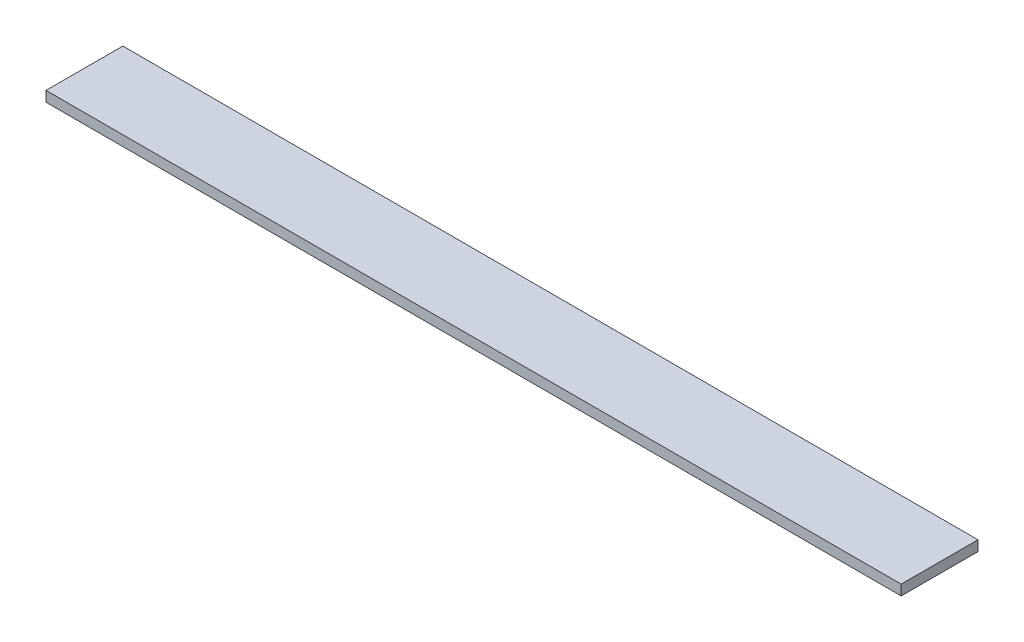
ISO-10303-21;
HEADER;
FILE_DESCRIPTION(('STEP AP214'),'2;1');
FILE_NAME('part.step','',(''),(''),'','','');
FILE_SCHEMA(('AUTOMOTIVE_DESIGN { 1 0 10303 214 1 1 1 1 }'));
ENDSEC;
DATA;
#1=APPLICATION_CONTEXT('core data for automotive mechanical design processes');
#2=APPLICATION_PROTOCOL_DEFINITION('international standard','automotive_design',2000,#1);
#3=PRODUCT_CONTEXT('',#1,'mechanical');
#4=PRODUCT('Part','Part','',(#3));
#5=PRODUCT_RELATED_PRODUCT_CATEGORY('part','',(#4));
#6=PRODUCT_DEFINITION_FORMATION('','',#4);
#7=PRODUCT_DEFINITION_CONTEXT('part definition',#1,'design');
#8=PRODUCT_DEFINITION('design','',#6,#7);
#9=PRODUCT_DEFINITION_SHAPE('','',#8);
#10=(LENGTH_UNIT() NAMED_UNIT(*) SI_UNIT(.MILLI.,.METRE.));
#11=(NAMED_UNIT(*) PLANE_ANGLE_UNIT() SI_UNIT($,.RADIAN.));
#12=(NAMED_UNIT(*) SI_UNIT($,.STERADIAN.) SOLID_ANGLE_UNIT());
#13=UNCERTAINTY_MEASURE_WITH_UNIT(LENGTH_MEASURE(1.E-05),#10,'distance_accuracy_value','');
#14=(GEOMETRIC_REPRESENTATION_CONTEXT(3) GLOBAL_UNCERTAINTY_ASSIGNED_CONTEXT((#13)) GLOBAL_UNIT_ASSIGNED_CONTEXT((#10,
#11,#12)) REPRESENTATION_CONTEXT('',''));
#15=CARTESIAN_POINT('',(0.,0.,0.));
#16=DIRECTION('',(0.,0.,1.));
#17=DIRECTION('',(1.,0.,0.));
#18=AXIS2_PLACEMENT_3D('',#15,#16,#17);
#19=CARTESIAN_POINT('',(334.,-2.,-15.));
#20=DIRECTION('',(0.,0.,1.));
#21=DIRECTION('',(1.,0.,0.));
#22=AXIS2_PLACEMENT_3D('',#19,#20,#21);
#23=PLANE('',#22);
#24=DIRECTION('',(0.,1.,0.));
#25=VECTOR('',#24,1.);
#26=CARTESIAN_POINT('',(0.,-2.,-15.));
#27=LINE('',#26,#25);
#28=CARTESIAN_POINT('',(0.,-2.,-15.));
#29=VERTEX_POINT('',#28);
#30=CARTESIAN_POINT('',(0.,2.,-15.));
#31=VERTEX_POINT('',#30);
#32=EDGE_CURVE('E97',#29,#31,#27,.T.);
#33=ORIENTED_EDGE('',*,*,#32,.T.);
#34=DIRECTION('',(-1.,0.,0.));
#35=VECTOR('',#34,1.);
#36=CARTESIAN_POINT('',(334.,2.,-15.));
#37=LINE('',#36,#35);
#38=CARTESIAN_POINT('',(334.,2.,-15.));
#39=VERTEX_POINT('',#38);
#40=EDGE_CURVE('E11',#39,#31,#37,.T.);
#41=ORIENTED_EDGE('',*,*,#40,.F.);
#42=DIRECTION('',(0.,1.,0.));
#43=VECTOR('',#42,1.);
#44=CARTESIAN_POINT('',(334.,-2.,-15.));
#45=LINE('',#44,#43);
#46=CARTESIAN_POINT('',(334.,-2.,-15.));
#47=VERTEX_POINT('',#46);
#48=EDGE_CURVE('E85',#47,#39,#45,.T.);
#49=ORIENTED_EDGE('',*,*,#48,.F.);
#50=DIRECTION('',(-1.,0.,0.));
#51=VECTOR('',#50,1.);
#52=CARTESIAN_POINT('',(334.,-2.,-15.));
#53=LINE('',#52,#51);
#54=EDGE_CURVE('E93',#47,#29,#53,.T.);
#55=ORIENTED_EDGE('',*,*,#54,.T.);
#56=EDGE_LOOP('',(#33,#41,#49,#55));
#57=FACE_BOUND('',#56,.T.);
#58=ADVANCED_FACE('F34',(#57),#23,.F.);
#59=CARTESIAN_POINT('',(334.,2.,15.));
#60=DIRECTION('',(0.,-1.,0.));
#61=DIRECTION('',(0.,0.,-1.));
#62=AXIS2_PLACEMENT_3D('',#59,#60,#61);
#63=PLANE('',#62);
#64=DIRECTION('',(0.,0.,1.));
#65=VECTOR('',#64,1.);
#66=CARTESIAN_POINT('',(0.,2.,15.));
#67=LINE('',#66,#65);
#68=CARTESIAN_POINT('',(0.,2.,15.));
#69=VERTEX_POINT('',#68);
#70=EDGE_CURVE('E89',#31,#69,#67,.T.);
#71=ORIENTED_EDGE('',*,*,#70,.T.);
#72=DIRECTION('',(-1.,0.,0.));
#73=VECTOR('',#72,1.);
#74=CARTESIAN_POINT('',(334.,2.,15.));
#75=LINE('',#74,#73);
#76=CARTESIAN_POINT('',(334.,2.,15.));
#77=VERTEX_POINT('',#76);
#78=EDGE_CURVE('E42',#77,#69,#75,.T.);
#79=ORIENTED_EDGE('',*,*,#78,.F.);
#80=DIRECTION('',(0.,0.,1.));
#81=VECTOR('',#80,1.);
#82=CARTESIAN_POINT('',(334.,2.,15.));
#83=LINE('',#82,#81);
#84=EDGE_CURVE('E80',#39,#77,#83,.T.);
#85=ORIENTED_EDGE('',*,*,#84,.F.);
#86=ORIENTED_EDGE('',*,*,#40,.T.);
#87=EDGE_LOOP('',(#71,#79,#85,#86));
#88=FACE_BOUND('',#87,.T.);
#89=ADVANCED_FACE('F88',(#88),#63,.F.);
#90=CARTESIAN_POINT('',(334.,-2.,15.));
#91=DIRECTION('',(0.,0.,-1.));
#92=DIRECTION('',(-1.,0.,0.));
#93=AXIS2_PLACEMENT_3D('',#90,#91,#92);
#94=PLANE('',#93);
#95=DIRECTION('',(0.,-1.,0.));
#96=VECTOR('',#95,1.);
#97=CARTESIAN_POINT('',(0.,-2.,15.));
#98=LINE('',#97,#96);
#99=CARTESIAN_POINT('',(0.,-2.,15.));
#100=VERTEX_POINT('',#99);
#101=EDGE_CURVE('E67',#69,#100,#98,.T.);
#102=ORIENTED_EDGE('',*,*,#101,.T.);
#103=DIRECTION('',(-1.,0.,0.));
#104=VECTOR('',#103,1.);
#105=CARTESIAN_POINT('',(334.,-2.,15.));
#106=LINE('',#105,#104);
#107=CARTESIAN_POINT('',(334.,-2.,15.));
#108=VERTEX_POINT('',#107);
#109=EDGE_CURVE('E90',#108,#100,#106,.T.);
#110=ORIENTED_EDGE('',*,*,#109,.F.);
#111=DIRECTION('',(0.,-1.,0.));
#112=VECTOR('',#111,1.);
#113=CARTESIAN_POINT('',(334.,-2.,15.));
#114=LINE('',#113,#112);
#115=EDGE_CURVE('E83',#77,#108,#114,.T.);
#116=ORIENTED_EDGE('',*,*,#115,.F.);
#117=ORIENTED_EDGE('',*,*,#78,.T.);
#118=EDGE_LOOP('',(#102,#110,#116,#117));
#119=FACE_BOUND('',#118,.T.);
#120=ADVANCED_FACE('F91',(#119),#94,.F.);
#121=CARTESIAN_POINT('',(334.,-2.,15.));
#122=DIRECTION('',(0.,1.,0.));
#123=DIRECTION('',(0.,0.,1.));
#124=AXIS2_PLACEMENT_3D('',#121,#122,#123);
#125=PLANE('',#124);
#126=DIRECTION('',(0.,0.,-1.));
#127=VECTOR('',#126,1.);
#128=CARTESIAN_POINT('',(0.,-2.,15.));
#129=LINE('',#128,#127);
#130=EDGE_CURVE('E73',#100,#29,#129,.T.);
#131=ORIENTED_EDGE('',*,*,#130,.T.);
#132=ORIENTED_EDGE('',*,*,#54,.F.);
#133=DIRECTION('',(0.,0.,-1.));
#134=VECTOR('',#133,1.);
#135=CARTESIAN_POINT('',(334.,-2.,15.));
#136=LINE('',#135,#134);
#137=EDGE_CURVE('E50',#108,#47,#136,.T.);
#138=ORIENTED_EDGE('',*,*,#137,.F.);
#139=ORIENTED_EDGE('',*,*,#109,.T.);
#140=EDGE_LOOP('',(#131,#132,#138,#139));
#141=FACE_BOUND('',#140,.T.);
#142=ADVANCED_FACE('F104',(#141),#125,.F.);
#143=CARTESIAN_POINT('',(334.,0.,0.));
#144=DIRECTION('',(-1.,0.,0.));
#145=DIRECTION('',(0.,0.,1.));
#146=AXIS2_PLACEMENT_3D('',#143,#144,#145);
#147=PLANE('',#146);
#148=ORIENTED_EDGE('',*,*,#48,.T.);
#149=ORIENTED_EDGE('',*,*,#84,.T.);
#150=ORIENTED_EDGE('',*,*,#115,.T.);
#151=ORIENTED_EDGE('',*,*,#137,.T.);
#152=EDGE_LOOP('',(#148,#149,#150,#151));
#153=FACE_BOUND('',#152,.T.);
#154=ADVANCED_FACE('F81',(#153),#147,.F.);
#155=CARTESIAN_POINT('',(0.,0.,0.));
#156=DIRECTION('',(-1.,0.,0.));
#157=DIRECTION('',(0.,0.,1.));
#158=AXIS2_PLACEMENT_3D('',#155,#156,#157);
#159=PLANE('',#158);
#160=ORIENTED_EDGE('',*,*,#32,.F.);
#161=ORIENTED_EDGE('',*,*,#130,.F.);
#162=ORIENTED_EDGE('',*,*,#101,.F.);
#163=ORIENTED_EDGE('',*,*,#70,.F.);
#164=EDGE_LOOP('',(#160,#161,#162,#163));
#165=FACE_BOUND('',#164,.T.);
#166=ADVANCED_FACE('F107',(#165),#159,.T.);
#167=CLOSED_SHELL('',(#58,#89,#120,#142,#154,#166));
#168=MANIFOLD_SOLID_BREP('B2',#167);
#169=ADVANCED_BREP_SHAPE_REPRESENTATION('',(#18,#168),#14);
#170=SHAPE_DEFINITION_REPRESENTATION(#9,#169);
ENDSEC;
END-ISO-10303-21;
